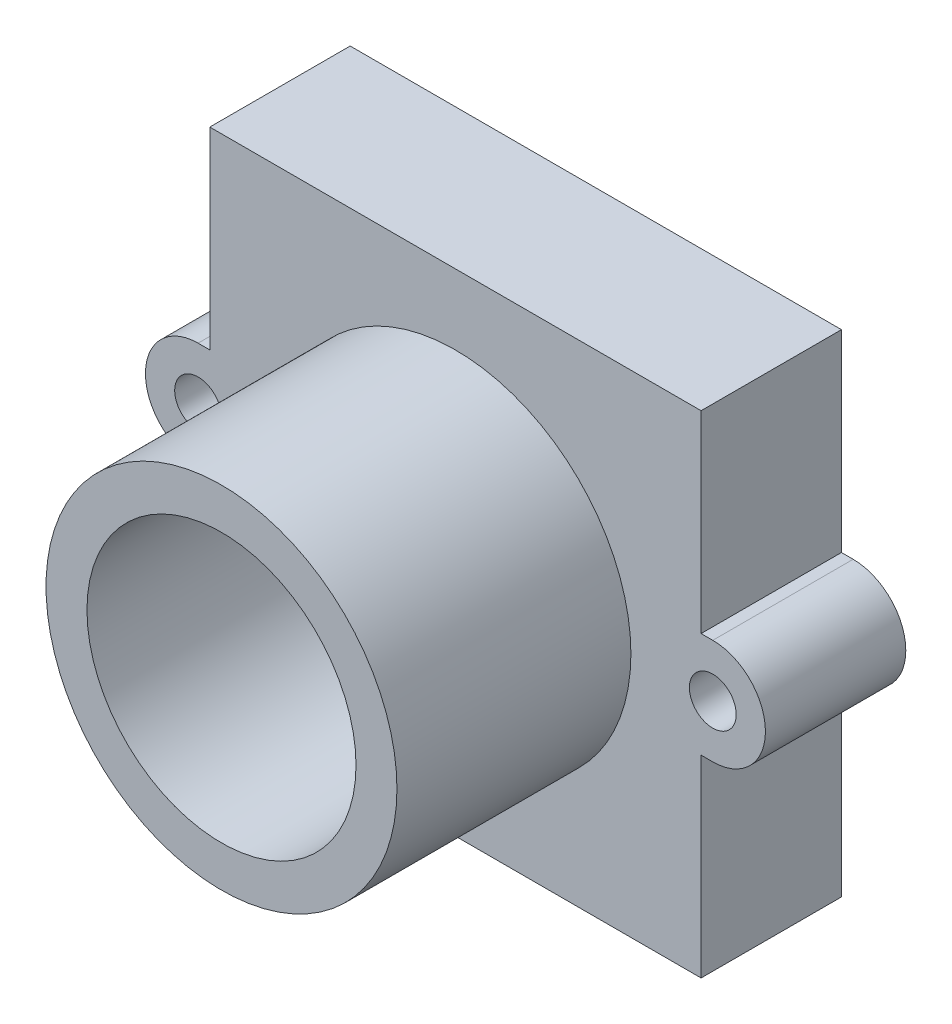
ISO-10303-21;
HEADER;
FILE_DESCRIPTION(('STEP AP214'),'2;1');
FILE_NAME('part.step','',(''),(''),'','','');
FILE_SCHEMA(('AUTOMOTIVE_DESIGN { 1 0 10303 214 1 1 1 1 }'));
ENDSEC;
DATA;
#1=APPLICATION_CONTEXT('core data for automotive mechanical design processes');
#2=APPLICATION_PROTOCOL_DEFINITION('international standard','automotive_design',2000,#1);
#3=PRODUCT_CONTEXT('',#1,'mechanical');
#4=PRODUCT('Part','Part','',(#3));
#5=PRODUCT_RELATED_PRODUCT_CATEGORY('part','',(#4));
#6=PRODUCT_DEFINITION_FORMATION('','',#4);
#7=PRODUCT_DEFINITION_CONTEXT('part definition',#1,'design');
#8=PRODUCT_DEFINITION('design','',#6,#7);
#9=PRODUCT_DEFINITION_SHAPE('','',#8);
#10=(LENGTH_UNIT() NAMED_UNIT(*) SI_UNIT(.MILLI.,.METRE.));
#11=(NAMED_UNIT(*) PLANE_ANGLE_UNIT() SI_UNIT($,.RADIAN.));
#12=(NAMED_UNIT(*) SI_UNIT($,.STERADIAN.) SOLID_ANGLE_UNIT());
#13=UNCERTAINTY_MEASURE_WITH_UNIT(LENGTH_MEASURE(1.E-05),#10,'distance_accuracy_value','');
#14=(GEOMETRIC_REPRESENTATION_CONTEXT(3) GLOBAL_UNCERTAINTY_ASSIGNED_CONTEXT((#13)) GLOBAL_UNIT_ASSIGNED_CONTEXT((#10,
#11,#12)) REPRESENTATION_CONTEXT('',''));
#15=CARTESIAN_POINT('',(0.,0.,0.));
#16=DIRECTION('',(0.,0.,1.));
#17=DIRECTION('',(1.,0.,0.));
#18=AXIS2_PLACEMENT_3D('',#15,#16,#17);
#19=CARTESIAN_POINT('',(0.,0.,6.));
#20=DIRECTION('',(0.,0.,1.));
#21=DIRECTION('',(1.,0.,0.));
#22=AXIS2_PLACEMENT_3D('',#19,#20,#21);
#23=PLANE('',#22);
#24=CARTESIAN_POINT('',(-11.,0.,6.));
#25=DIRECTION('',(0.,0.,1.));
#26=DIRECTION('',(1.,0.,0.));
#27=AXIS2_PLACEMENT_3D('',#24,#25,#26);
#28=CIRCLE('',#27,0.999999999999987);
#29=CARTESIAN_POINT('',(-10.,0.,6.));
#30=VERTEX_POINT('',#29);
#31=EDGE_CURVE('E585',#30,#30,#28,.T.);
#32=ORIENTED_EDGE('',*,*,#31,.F.);
#33=EDGE_LOOP('',(#32));
#34=FACE_BOUND('',#33,.T.);
#35=CARTESIAN_POINT('',(11.,0.,6.));
#36=DIRECTION('',(0.,0.,1.));
#37=DIRECTION('',(1.,0.,0.));
#38=AXIS2_PLACEMENT_3D('',#35,#36,#37);
#39=CIRCLE('',#38,0.999999999999987);
#40=CARTESIAN_POINT('',(12.,0.,6.));
#41=VERTEX_POINT('',#40);
#42=EDGE_CURVE('E587',#41,#41,#39,.T.);
#43=ORIENTED_EDGE('',*,*,#42,.F.);
#44=EDGE_LOOP('',(#43));
#45=FACE_BOUND('',#44,.T.);
#46=CARTESIAN_POINT('',(11.,0.,6.));
#47=DIRECTION('',(0.,0.,1.));
#48=DIRECTION('',(1.,0.,0.));
#49=AXIS2_PLACEMENT_3D('',#46,#47,#48);
#50=CIRCLE('',#49,2.25);
#51=CARTESIAN_POINT('',(11.,2.25,6.));
#52=VERTEX_POINT('',#51);
#53=CARTESIAN_POINT('',(11.,-2.25,6.));
#54=VERTEX_POINT('',#53);
#55=EDGE_CURVE('E179',#52,#54,#50,.F.);
#56=ORIENTED_EDGE('',*,*,#55,.F.);
#57=DIRECTION('',(1.,0.,0.));
#58=VECTOR('',#57,1.);
#59=CARTESIAN_POINT('',(0.,2.25000000000001,6.));
#60=LINE('',#59,#58);
#61=CARTESIAN_POINT('',(10.5,2.25,6.));
#62=VERTEX_POINT('',#61);
#63=EDGE_CURVE('E194',#62,#52,#60,.T.);
#64=ORIENTED_EDGE('',*,*,#63,.F.);
#65=DIRECTION('',(0.,-1.,0.));
#66=VECTOR('',#65,1.);
#67=CARTESIAN_POINT('',(10.5,0.,6.));
#68=LINE('',#67,#66);
#69=CARTESIAN_POINT('',(10.5,10.5,6.));
#70=VERTEX_POINT('',#69);
#71=EDGE_CURVE('E202',#70,#62,#68,.T.);
#72=ORIENTED_EDGE('',*,*,#71,.F.);
#73=DIRECTION('',(1.,0.,0.));
#74=VECTOR('',#73,1.);
#75=CARTESIAN_POINT('',(0.,10.5,6.));
#76=LINE('',#75,#74);
#77=CARTESIAN_POINT('',(-10.5,10.5,6.));
#78=VERTEX_POINT('',#77);
#79=EDGE_CURVE('E204',#78,#70,#76,.T.);
#80=ORIENTED_EDGE('',*,*,#79,.F.);
#81=DIRECTION('',(0.,-1.,0.));
#82=VECTOR('',#81,1.);
#83=CARTESIAN_POINT('',(-10.5,0.,6.));
#84=LINE('',#83,#82);
#85=CARTESIAN_POINT('',(-10.5,2.25,6.));
#86=VERTEX_POINT('',#85);
#87=EDGE_CURVE('E210',#78,#86,#84,.T.);
#88=ORIENTED_EDGE('',*,*,#87,.T.);
#89=DIRECTION('',(-1.,0.,0.));
#90=VECTOR('',#89,1.);
#91=CARTESIAN_POINT('',(0.,2.25000000000001,6.));
#92=LINE('',#91,#90);
#93=CARTESIAN_POINT('',(-11.,2.25,6.));
#94=VERTEX_POINT('',#93);
#95=EDGE_CURVE('E213',#86,#94,#92,.T.);
#96=ORIENTED_EDGE('',*,*,#95,.T.);
#97=CARTESIAN_POINT('',(-11.,0.,6.));
#98=DIRECTION('',(0.,0.,1.));
#99=DIRECTION('',(1.,0.,0.));
#100=AXIS2_PLACEMENT_3D('',#97,#98,#99);
#101=CIRCLE('',#100,2.25);
#102=CARTESIAN_POINT('',(-11.,-2.25,6.));
#103=VERTEX_POINT('',#102);
#104=EDGE_CURVE('E216',#94,#103,#101,.T.);
#105=ORIENTED_EDGE('',*,*,#104,.T.);
#106=DIRECTION('',(1.,0.,0.));
#107=VECTOR('',#106,1.);
#108=CARTESIAN_POINT('',(0.,-2.25,6.));
#109=LINE('',#108,#107);
#110=CARTESIAN_POINT('',(-10.5,-2.25,6.));
#111=VERTEX_POINT('',#110);
#112=EDGE_CURVE('E219',#103,#111,#109,.T.);
#113=ORIENTED_EDGE('',*,*,#112,.T.);
#114=DIRECTION('',(0.,-1.,0.));
#115=VECTOR('',#114,1.);
#116=CARTESIAN_POINT('',(-10.5,0.,6.));
#117=LINE('',#116,#115);
#118=CARTESIAN_POINT('',(-10.5,-10.5,6.));
#119=VERTEX_POINT('',#118);
#120=EDGE_CURVE('E222',#111,#119,#117,.T.);
#121=ORIENTED_EDGE('',*,*,#120,.T.);
#122=DIRECTION('',(1.,0.,0.));
#123=VECTOR('',#122,1.);
#124=CARTESIAN_POINT('',(0.,-10.5,6.));
#125=LINE('',#124,#123);
#126=CARTESIAN_POINT('',(10.5,-10.5,6.));
#127=VERTEX_POINT('',#126);
#128=EDGE_CURVE('E225',#119,#127,#125,.T.);
#129=ORIENTED_EDGE('',*,*,#128,.T.);
#130=DIRECTION('',(0.,-1.,0.));
#131=VECTOR('',#130,1.);
#132=CARTESIAN_POINT('',(10.5,0.,6.));
#133=LINE('',#132,#131);
#134=CARTESIAN_POINT('',(10.5,-2.25,6.));
#135=VERTEX_POINT('',#134);
#136=EDGE_CURVE('E228',#135,#127,#133,.T.);
#137=ORIENTED_EDGE('',*,*,#136,.F.);
#138=DIRECTION('',(-1.,0.,0.));
#139=VECTOR('',#138,1.);
#140=CARTESIAN_POINT('',(0.,-2.25,6.));
#141=LINE('',#140,#139);
#142=EDGE_CURVE('E198',#54,#135,#141,.T.);
#143=ORIENTED_EDGE('',*,*,#142,.F.);
#144=EDGE_LOOP('',(#56,#64,#72,#80,#88,#96,#105,#113,#121,#129,#137,#143));
#145=FACE_BOUND('',#144,.T.);
#146=CARTESIAN_POINT('',(0.,0.,6.));
#147=DIRECTION('',(0.,0.,1.));
#148=DIRECTION('',(1.,0.,0.));
#149=AXIS2_PLACEMENT_3D('',#146,#147,#148);
#150=CIRCLE('',#149,7.5);
#151=CARTESIAN_POINT('',(7.5,0.,6.));
#152=VERTEX_POINT('',#151);
#153=EDGE_CURVE('E601',#152,#152,#150,.T.);
#154=ORIENTED_EDGE('',*,*,#153,.F.);
#155=EDGE_LOOP('',(#154));
#156=FACE_BOUND('',#155,.T.);
#157=ADVANCED_FACE('F37',(#34,#45,#145,#156),#23,.T.);
#158=CARTESIAN_POINT('',(-10.5,10.5,0.));
#159=DIRECTION('',(-1.,0.,0.));
#160=DIRECTION('',(0.,0.,1.));
#161=AXIS2_PLACEMENT_3D('',#158,#159,#160);
#162=PLANE('',#161);
#163=DIRECTION('',(0.,0.,1.));
#164=VECTOR('',#163,1.);
#165=CARTESIAN_POINT('',(-10.5,2.25,0.));
#166=LINE('',#165,#164);
#167=CARTESIAN_POINT('',(-10.5,2.25,0.));
#168=VERTEX_POINT('',#167);
#169=EDGE_CURVE('E41',#168,#86,#166,.T.);
#170=ORIENTED_EDGE('',*,*,#169,.T.);
#171=ORIENTED_EDGE('',*,*,#87,.F.);
#172=DIRECTION('',(0.,0.,1.));
#173=VECTOR('',#172,1.);
#174=CARTESIAN_POINT('',(-10.5,10.5,0.));
#175=LINE('',#174,#173);
#176=CARTESIAN_POINT('',(-10.5,10.5,0.));
#177=VERTEX_POINT('',#176);
#178=EDGE_CURVE('E11',#177,#78,#175,.T.);
#179=ORIENTED_EDGE('',*,*,#178,.F.);
#180=DIRECTION('',(0.,-1.,0.));
#181=VECTOR('',#180,1.);
#182=CARTESIAN_POINT('',(-10.5,10.5,0.));
#183=LINE('',#182,#181);
#184=EDGE_CURVE('E282',#177,#168,#183,.T.);
#185=ORIENTED_EDGE('',*,*,#184,.T.);
#186=EDGE_LOOP('',(#170,#171,#179,#185));
#187=FACE_BOUND('',#186,.T.);
#188=ADVANCED_FACE('F39',(#187),#162,.T.);
#189=CARTESIAN_POINT('',(-10.5,10.5,0.));
#190=DIRECTION('',(0.,1.,0.));
#191=DIRECTION('',(0.,0.,1.));
#192=AXIS2_PLACEMENT_3D('',#189,#190,#191);
#193=PLANE('',#192);
#194=ORIENTED_EDGE('',*,*,#178,.T.);
#195=ORIENTED_EDGE('',*,*,#79,.T.);
#196=DIRECTION('',(0.,0.,1.));
#197=VECTOR('',#196,1.);
#198=CARTESIAN_POINT('',(10.5,10.5,0.));
#199=LINE('',#198,#197);
#200=CARTESIAN_POINT('',(10.5,10.5,0.));
#201=VERTEX_POINT('',#200);
#202=EDGE_CURVE('E46',#201,#70,#199,.T.);
#203=ORIENTED_EDGE('',*,*,#202,.F.);
#204=DIRECTION('',(-1.,0.,0.));
#205=VECTOR('',#204,1.);
#206=CARTESIAN_POINT('',(-10.5,10.5,0.));
#207=LINE('',#206,#205);
#208=EDGE_CURVE('E330',#201,#177,#207,.T.);
#209=ORIENTED_EDGE('',*,*,#208,.T.);
#210=EDGE_LOOP('',(#194,#195,#203,#209));
#211=FACE_BOUND('',#210,.T.);
#212=ADVANCED_FACE('F371',(#211),#193,.T.);
#213=CARTESIAN_POINT('',(10.5,10.5,0.));
#214=DIRECTION('',(1.,0.,0.));
#215=DIRECTION('',(0.,0.,-1.));
#216=AXIS2_PLACEMENT_3D('',#213,#214,#215);
#217=PLANE('',#216);
#218=ORIENTED_EDGE('',*,*,#202,.T.);
#219=ORIENTED_EDGE('',*,*,#71,.T.);
#220=DIRECTION('',(0.,0.,1.));
#221=VECTOR('',#220,1.);
#222=CARTESIAN_POINT('',(10.5,2.25,0.));
#223=LINE('',#222,#221);
#224=CARTESIAN_POINT('',(10.5,2.25,0.));
#225=VERTEX_POINT('',#224);
#226=EDGE_CURVE('E187',#225,#62,#223,.T.);
#227=ORIENTED_EDGE('',*,*,#226,.F.);
#228=DIRECTION('',(0.,1.,0.));
#229=VECTOR('',#228,1.);
#230=CARTESIAN_POINT('',(10.5,10.5,0.));
#231=LINE('',#230,#229);
#232=EDGE_CURVE('E327',#225,#201,#231,.T.);
#233=ORIENTED_EDGE('',*,*,#232,.T.);
#234=EDGE_LOOP('',(#218,#219,#227,#233));
#235=FACE_BOUND('',#234,.T.);
#236=ADVANCED_FACE('F414',(#235),#217,.T.);
#237=CARTESIAN_POINT('',(10.5,2.25,0.));
#238=DIRECTION('',(0.,1.,0.));
#239=DIRECTION('',(-1.,0.,0.));
#240=AXIS2_PLACEMENT_3D('',#237,#238,#239);
#241=PLANE('',#240);
#242=ORIENTED_EDGE('',*,*,#226,.T.);
#243=ORIENTED_EDGE('',*,*,#63,.T.);
#244=DIRECTION('',(0.,0.,1.));
#245=VECTOR('',#244,1.);
#246=CARTESIAN_POINT('',(11.,2.25,0.));
#247=LINE('',#246,#245);
#248=CARTESIAN_POINT('',(11.,2.25,0.));
#249=VERTEX_POINT('',#248);
#250=EDGE_CURVE('E176',#249,#52,#247,.T.);
#251=ORIENTED_EDGE('',*,*,#250,.F.);
#252=DIRECTION('',(-1.,0.,0.));
#253=VECTOR('',#252,1.);
#254=CARTESIAN_POINT('',(10.5,2.25,0.));
#255=LINE('',#254,#253);
#256=EDGE_CURVE('E325',#249,#225,#255,.T.);
#257=ORIENTED_EDGE('',*,*,#256,.T.);
#258=EDGE_LOOP('',(#242,#243,#251,#257));
#259=FACE_BOUND('',#258,.T.);
#260=ADVANCED_FACE('F201',(#259),#241,.T.);
#261=CARTESIAN_POINT('',(11.,0.,0.));
#262=DIRECTION('',(0.,0.,1.));
#263=DIRECTION('',(1.,0.,0.));
#264=AXIS2_PLACEMENT_3D('',#261,#262,#263);
#265=CYLINDRICAL_SURFACE('',#264,2.25);
#266=ORIENTED_EDGE('',*,*,#250,.T.);
#267=ORIENTED_EDGE('',*,*,#55,.T.);
#268=DIRECTION('',(0.,0.,1.));
#269=VECTOR('',#268,1.);
#270=CARTESIAN_POINT('',(11.,-2.25,0.));
#271=LINE('',#270,#269);
#272=CARTESIAN_POINT('',(11.,-2.25,0.));
#273=VERTEX_POINT('',#272);
#274=EDGE_CURVE('E188',#273,#54,#271,.T.);
#275=ORIENTED_EDGE('',*,*,#274,.F.);
#276=CARTESIAN_POINT('',(11.,0.,0.));
#277=DIRECTION('',(0.,0.,1.));
#278=DIRECTION('',(-1.,0.,0.));
#279=AXIS2_PLACEMENT_3D('',#276,#277,#278);
#280=CIRCLE('',#279,2.25);
#281=EDGE_CURVE('E182',#273,#249,#280,.T.);
#282=ORIENTED_EDGE('',*,*,#281,.T.);
#283=EDGE_LOOP('',(#266,#267,#275,#282));
#284=FACE_BOUND('',#283,.T.);
#285=ADVANCED_FACE('F178',(#284),#265,.T.);
#286=CARTESIAN_POINT('',(11.,-2.25,0.));
#287=DIRECTION('',(0.,-1.,0.));
#288=DIRECTION('',(0.,0.,-1.));
#289=AXIS2_PLACEMENT_3D('',#286,#287,#288);
#290=PLANE('',#289);
#291=ORIENTED_EDGE('',*,*,#274,.T.);
#292=ORIENTED_EDGE('',*,*,#142,.T.);
#293=DIRECTION('',(0.,0.,1.));
#294=VECTOR('',#293,1.);
#295=CARTESIAN_POINT('',(10.5,-2.25,0.));
#296=LINE('',#295,#294);
#297=CARTESIAN_POINT('',(10.5,-2.25,0.));
#298=VERTEX_POINT('',#297);
#299=EDGE_CURVE('E336',#298,#135,#296,.T.);
#300=ORIENTED_EDGE('',*,*,#299,.F.);
#301=DIRECTION('',(1.,0.,0.));
#302=VECTOR('',#301,1.);
#303=CARTESIAN_POINT('',(11.,-2.25,0.));
#304=LINE('',#303,#302);
#305=EDGE_CURVE('E321',#298,#273,#304,.T.);
#306=ORIENTED_EDGE('',*,*,#305,.T.);
#307=EDGE_LOOP('',(#291,#292,#300,#306));
#308=FACE_BOUND('',#307,.T.);
#309=ADVANCED_FACE('F423',(#308),#290,.T.);
#310=CARTESIAN_POINT('',(10.5,-2.25,0.));
#311=DIRECTION('',(1.,0.,0.));
#312=DIRECTION('',(0.,0.,-1.));
#313=AXIS2_PLACEMENT_3D('',#310,#311,#312);
#314=PLANE('',#313);
#315=ORIENTED_EDGE('',*,*,#299,.T.);
#316=ORIENTED_EDGE('',*,*,#136,.T.);
#317=DIRECTION('',(0.,0.,1.));
#318=VECTOR('',#317,1.);
#319=CARTESIAN_POINT('',(10.5,-10.5,0.));
#320=LINE('',#319,#318);
#321=CARTESIAN_POINT('',(10.5,-10.5,0.));
#322=VERTEX_POINT('',#321);
#323=EDGE_CURVE('E338',#322,#127,#320,.T.);
#324=ORIENTED_EDGE('',*,*,#323,.F.);
#325=DIRECTION('',(0.,1.,0.));
#326=VECTOR('',#325,1.);
#327=CARTESIAN_POINT('',(10.5,-2.25,0.));
#328=LINE('',#327,#326);
#329=EDGE_CURVE('E318',#322,#298,#328,.T.);
#330=ORIENTED_EDGE('',*,*,#329,.T.);
#331=EDGE_LOOP('',(#315,#316,#324,#330));
#332=FACE_BOUND('',#331,.T.);
#333=ADVANCED_FACE('F426',(#332),#314,.T.);
#334=CARTESIAN_POINT('',(-10.5,-10.5,0.));
#335=DIRECTION('',(0.,-1.,0.));
#336=DIRECTION('',(0.,0.,-1.));
#337=AXIS2_PLACEMENT_3D('',#334,#335,#336);
#338=PLANE('',#337);
#339=ORIENTED_EDGE('',*,*,#323,.T.);
#340=ORIENTED_EDGE('',*,*,#128,.F.);
#341=DIRECTION('',(0.,0.,1.));
#342=VECTOR('',#341,1.);
#343=CARTESIAN_POINT('',(-10.5,-10.5,0.));
#344=LINE('',#343,#342);
#345=CARTESIAN_POINT('',(-10.5,-10.5,0.));
#346=VERTEX_POINT('',#345);
#347=EDGE_CURVE('E340',#346,#119,#344,.T.);
#348=ORIENTED_EDGE('',*,*,#347,.F.);
#349=DIRECTION('',(1.,0.,0.));
#350=VECTOR('',#349,1.);
#351=CARTESIAN_POINT('',(-10.5,-10.5,0.));
#352=LINE('',#351,#350);
#353=EDGE_CURVE('E315',#346,#322,#352,.T.);
#354=ORIENTED_EDGE('',*,*,#353,.T.);
#355=EDGE_LOOP('',(#339,#340,#348,#354));
#356=FACE_BOUND('',#355,.T.);
#357=ADVANCED_FACE('F430',(#356),#338,.T.);
#358=CARTESIAN_POINT('',(-10.5,-2.25,0.));
#359=DIRECTION('',(-1.,0.,0.));
#360=DIRECTION('',(0.,0.,1.));
#361=AXIS2_PLACEMENT_3D('',#358,#359,#360);
#362=PLANE('',#361);
#363=ORIENTED_EDGE('',*,*,#347,.T.);
#364=ORIENTED_EDGE('',*,*,#120,.F.);
#365=DIRECTION('',(0.,0.,1.));
#366=VECTOR('',#365,1.);
#367=CARTESIAN_POINT('',(-10.5,-2.25,0.));
#368=LINE('',#367,#366);
#369=CARTESIAN_POINT('',(-10.5,-2.25,0.));
#370=VERTEX_POINT('',#369);
#371=EDGE_CURVE('E342',#370,#111,#368,.T.);
#372=ORIENTED_EDGE('',*,*,#371,.F.);
#373=DIRECTION('',(0.,-1.,0.));
#374=VECTOR('',#373,1.);
#375=CARTESIAN_POINT('',(-10.5,-2.25,0.));
#376=LINE('',#375,#374);
#377=EDGE_CURVE('E312',#370,#346,#376,.T.);
#378=ORIENTED_EDGE('',*,*,#377,.T.);
#379=EDGE_LOOP('',(#363,#364,#372,#378));
#380=FACE_BOUND('',#379,.T.);
#381=ADVANCED_FACE('F434',(#380),#362,.T.);
#382=CARTESIAN_POINT('',(-11.,-2.25,0.));
#383=DIRECTION('',(0.,-1.,0.));
#384=DIRECTION('',(0.,0.,-1.));
#385=AXIS2_PLACEMENT_3D('',#382,#383,#384);
#386=PLANE('',#385);
#387=ORIENTED_EDGE('',*,*,#371,.T.);
#388=ORIENTED_EDGE('',*,*,#112,.F.);
#389=DIRECTION('',(0.,0.,1.));
#390=VECTOR('',#389,1.);
#391=CARTESIAN_POINT('',(-11.,-2.25,0.));
#392=LINE('',#391,#390);
#393=CARTESIAN_POINT('',(-11.,-2.25,0.));
#394=VERTEX_POINT('',#393);
#395=EDGE_CURVE('E344',#394,#103,#392,.T.);
#396=ORIENTED_EDGE('',*,*,#395,.F.);
#397=DIRECTION('',(1.,0.,0.));
#398=VECTOR('',#397,1.);
#399=CARTESIAN_POINT('',(-11.,-2.25,0.));
#400=LINE('',#399,#398);
#401=EDGE_CURVE('E309',#394,#370,#400,.T.);
#402=ORIENTED_EDGE('',*,*,#401,.T.);
#403=EDGE_LOOP('',(#387,#388,#396,#402));
#404=FACE_BOUND('',#403,.T.);
#405=ADVANCED_FACE('F362',(#404),#386,.T.);
#406=CARTESIAN_POINT('',(-11.,0.,0.));
#407=DIRECTION('',(0.,0.,1.));
#408=DIRECTION('',(1.,0.,0.));
#409=AXIS2_PLACEMENT_3D('',#406,#407,#408);
#410=CYLINDRICAL_SURFACE('',#409,2.25);
#411=ORIENTED_EDGE('',*,*,#395,.T.);
#412=ORIENTED_EDGE('',*,*,#104,.F.);
#413=DIRECTION('',(0.,0.,1.));
#414=VECTOR('',#413,1.);
#415=CARTESIAN_POINT('',(-11.,2.25,0.));
#416=LINE('',#415,#414);
#417=CARTESIAN_POINT('',(-11.,2.25,0.));
#418=VERTEX_POINT('',#417);
#419=EDGE_CURVE('E345',#418,#94,#416,.T.);
#420=ORIENTED_EDGE('',*,*,#419,.F.);
#421=CARTESIAN_POINT('',(-11.,0.,0.));
#422=DIRECTION('',(0.,0.,1.));
#423=DIRECTION('',(1.,0.,0.));
#424=AXIS2_PLACEMENT_3D('',#421,#422,#423);
#425=CIRCLE('',#424,2.25);
#426=EDGE_CURVE('E306',#418,#394,#425,.T.);
#427=ORIENTED_EDGE('',*,*,#426,.T.);
#428=EDGE_LOOP('',(#411,#412,#420,#427));
#429=FACE_BOUND('',#428,.T.);
#430=ADVANCED_FACE('F354',(#429),#410,.T.);
#431=CARTESIAN_POINT('',(-10.5,2.25,0.));
#432=DIRECTION('',(0.,1.,0.));
#433=DIRECTION('',(-1.,0.,0.));
#434=AXIS2_PLACEMENT_3D('',#431,#432,#433);
#435=PLANE('',#434);
#436=ORIENTED_EDGE('',*,*,#419,.T.);
#437=ORIENTED_EDGE('',*,*,#95,.F.);
#438=ORIENTED_EDGE('',*,*,#169,.F.);
#439=DIRECTION('',(-1.,0.,0.));
#440=VECTOR('',#439,1.);
#441=CARTESIAN_POINT('',(-10.5,2.25,0.));
#442=LINE('',#441,#440);
#443=EDGE_CURVE('E303',#168,#418,#442,.T.);
#444=ORIENTED_EDGE('',*,*,#443,.T.);
#445=EDGE_LOOP('',(#436,#437,#438,#444));
#446=FACE_BOUND('',#445,.T.);
#447=ADVANCED_FACE('F351',(#446),#435,.T.);
#448=CARTESIAN_POINT('',(-11.,0.,0.));
#449=DIRECTION('',(0.,0.,1.));
#450=DIRECTION('',(1.,0.,0.));
#451=AXIS2_PLACEMENT_3D('',#448,#449,#450);
#452=PLANE('',#451);
#453=CARTESIAN_POINT('',(-11.,0.,0.));
#454=DIRECTION('',(0.,0.,1.));
#455=DIRECTION('',(1.,0.,0.));
#456=AXIS2_PLACEMENT_3D('',#453,#454,#455);
#457=CIRCLE('',#456,0.999999999999997);
#458=CARTESIAN_POINT('',(-10.,0.,0.));
#459=VERTEX_POINT('',#458);
#460=EDGE_CURVE('E583',#459,#459,#457,.T.);
#461=ORIENTED_EDGE('',*,*,#460,.T.);
#462=EDGE_LOOP('',(#461));
#463=FACE_BOUND('',#462,.T.);
#464=CARTESIAN_POINT('',(11.,0.,0.));
#465=DIRECTION('',(0.,0.,1.));
#466=DIRECTION('',(1.,0.,0.));
#467=AXIS2_PLACEMENT_3D('',#464,#465,#466);
#468=CIRCLE('',#467,0.999999999999997);
#469=CARTESIAN_POINT('',(12.,0.,0.));
#470=VERTEX_POINT('',#469);
#471=EDGE_CURVE('E592',#470,#470,#468,.T.);
#472=ORIENTED_EDGE('',*,*,#471,.T.);
#473=EDGE_LOOP('',(#472));
#474=FACE_BOUND('',#473,.T.);
#475=DIRECTION('',(0.707106781186547,-0.707106781186548,0.));
#476=VECTOR('',#475,1.);
#477=CARTESIAN_POINT('',(-9.,-6.48563850798539,0.));
#478=LINE('',#477,#476);
#479=CARTESIAN_POINT('',(-9.,-6.48563850798539,0.));
#480=VERTEX_POINT('',#479);
#481=CARTESIAN_POINT('',(-6.48563850798539,-9.,0.));
#482=VERTEX_POINT('',#481);
#483=EDGE_CURVE('E253',#480,#482,#478,.T.);
#484=ORIENTED_EDGE('',*,*,#483,.T.);
#485=DIRECTION('',(1.,0.,0.));
#486=VECTOR('',#485,1.);
#487=CARTESIAN_POINT('',(-6.48563850798539,-9.,0.));
#488=LINE('',#487,#486);
#489=CARTESIAN_POINT('',(6.48563850798539,-9.,0.));
#490=VERTEX_POINT('',#489);
#491=EDGE_CURVE('E233',#482,#490,#488,.T.);
#492=ORIENTED_EDGE('',*,*,#491,.T.);
#493=DIRECTION('',(0.707106781186548,0.707106781186548,0.));
#494=VECTOR('',#493,1.);
#495=CARTESIAN_POINT('',(6.48563850798539,-9.,0.));
#496=LINE('',#495,#494);
#497=CARTESIAN_POINT('',(9.,-6.48563850798539,0.));
#498=VERTEX_POINT('',#497);
#499=EDGE_CURVE('E236',#490,#498,#496,.T.);
#500=ORIENTED_EDGE('',*,*,#499,.T.);
#501=DIRECTION('',(0.,1.,0.));
#502=VECTOR('',#501,1.);
#503=CARTESIAN_POINT('',(9.,-6.48563850798539,0.));
#504=LINE('',#503,#502);
#505=CARTESIAN_POINT('',(9.,6.48563850798539,0.));
#506=VERTEX_POINT('',#505);
#507=EDGE_CURVE('E54',#498,#506,#504,.T.);
#508=ORIENTED_EDGE('',*,*,#507,.T.);
#509=DIRECTION('',(-0.707106781186547,0.707106781186548,0.));
#510=VECTOR('',#509,1.);
#511=CARTESIAN_POINT('',(9.,6.48563850798539,0.));
#512=LINE('',#511,#510);
#513=CARTESIAN_POINT('',(6.48563850798539,9.,0.));
#514=VERTEX_POINT('',#513);
#515=EDGE_CURVE('E241',#506,#514,#512,.T.);
#516=ORIENTED_EDGE('',*,*,#515,.T.);
#517=DIRECTION('',(-1.,0.,0.));
#518=VECTOR('',#517,1.);
#519=CARTESIAN_POINT('',(6.48563850798539,9.,0.));
#520=LINE('',#519,#518);
#521=CARTESIAN_POINT('',(-6.48563850798539,9.,0.));
#522=VERTEX_POINT('',#521);
#523=EDGE_CURVE('E244',#514,#522,#520,.T.);
#524=ORIENTED_EDGE('',*,*,#523,.T.);
#525=DIRECTION('',(-0.707106781186547,-0.707106781186548,0.));
#526=VECTOR('',#525,1.);
#527=CARTESIAN_POINT('',(-6.48563850798539,9.,0.));
#528=LINE('',#527,#526);
#529=CARTESIAN_POINT('',(-9.,6.48563850798539,0.));
#530=VERTEX_POINT('',#529);
#531=EDGE_CURVE('E247',#522,#530,#528,.T.);
#532=ORIENTED_EDGE('',*,*,#531,.T.);
#533=DIRECTION('',(0.,-1.,0.));
#534=VECTOR('',#533,1.);
#535=CARTESIAN_POINT('',(-9.,6.48563850798539,0.));
#536=LINE('',#535,#534);
#537=EDGE_CURVE('E250',#530,#480,#536,.T.);
#538=ORIENTED_EDGE('',*,*,#537,.T.);
#539=EDGE_LOOP('',(#484,#492,#500,#508,#516,#524,#532,#538));
#540=FACE_BOUND('',#539,.T.);
#541=ORIENTED_EDGE('',*,*,#184,.F.);
#542=ORIENTED_EDGE('',*,*,#208,.F.);
#543=ORIENTED_EDGE('',*,*,#232,.F.);
#544=ORIENTED_EDGE('',*,*,#256,.F.);
#545=ORIENTED_EDGE('',*,*,#281,.F.);
#546=ORIENTED_EDGE('',*,*,#305,.F.);
#547=ORIENTED_EDGE('',*,*,#329,.F.);
#548=ORIENTED_EDGE('',*,*,#353,.F.);
#549=ORIENTED_EDGE('',*,*,#377,.F.);
#550=ORIENTED_EDGE('',*,*,#401,.F.);
#551=ORIENTED_EDGE('',*,*,#426,.F.);
#552=ORIENTED_EDGE('',*,*,#443,.F.);
#553=EDGE_LOOP('',(#541,#542,#543,#544,#545,#546,#547,#548,#549,#550,#551,#552));
#554=FACE_BOUND('',#553,.T.);
#555=ADVANCED_FACE('F353',(#463,#474,#540,#554),#452,.F.);
#556=CARTESIAN_POINT('',(-6.48563850798539,-9.,0.));
#557=DIRECTION('',(0.,-1.,0.));
#558=DIRECTION('',(0.,0.,-1.));
#559=AXIS2_PLACEMENT_3D('',#556,#557,#558);
#560=PLANE('',#559);
#561=DIRECTION('',(1.,0.,0.));
#562=VECTOR('',#561,1.);
#563=CARTESIAN_POINT('',(-6.48563850798539,-9.,5.));
#564=LINE('',#563,#562);
#565=CARTESIAN_POINT('',(-6.48563850798539,-9.,5.));
#566=VERTEX_POINT('',#565);
#567=CARTESIAN_POINT('',(6.48563850798539,-9.,5.));
#568=VERTEX_POINT('',#567);
#569=EDGE_CURVE('E232',#566,#568,#564,.T.);
#570=ORIENTED_EDGE('',*,*,#569,.T.);
#571=DIRECTION('',(0.,0.,1.));
#572=VECTOR('',#571,1.);
#573=CARTESIAN_POINT('',(6.48563850798539,-9.,0.));
#574=LINE('',#573,#572);
#575=EDGE_CURVE('E256',#490,#568,#574,.T.);
#576=ORIENTED_EDGE('',*,*,#575,.F.);
#577=ORIENTED_EDGE('',*,*,#491,.F.);
#578=DIRECTION('',(0.,0.,1.));
#579=VECTOR('',#578,1.);
#580=CARTESIAN_POINT('',(-6.48563850798539,-9.,0.));
#581=LINE('',#580,#579);
#582=EDGE_CURVE('E279',#482,#566,#581,.T.);
#583=ORIENTED_EDGE('',*,*,#582,.T.);
#584=EDGE_LOOP('',(#570,#576,#577,#583));
#585=FACE_BOUND('',#584,.T.);
#586=ADVANCED_FACE('F359',(#585),#560,.F.);
#587=CARTESIAN_POINT('',(-9.,-6.48563850798539,0.));
#588=DIRECTION('',(-0.707106781186548,-0.707106781186547,0.));
#589=DIRECTION('',(0.707106781186547,-0.707106781186548,0.));
#590=AXIS2_PLACEMENT_3D('',#587,#588,#589);
#591=PLANE('',#590);
#592=DIRECTION('',(0.707106781186547,-0.707106781186548,0.));
#593=VECTOR('',#592,1.);
#594=CARTESIAN_POINT('',(-9.,-6.48563850798539,5.));
#595=LINE('',#594,#593);
#596=CARTESIAN_POINT('',(-9.,-6.48563850798539,5.));
#597=VERTEX_POINT('',#596);
#598=EDGE_CURVE('E237',#597,#566,#595,.T.);
#599=ORIENTED_EDGE('',*,*,#598,.T.);
#600=ORIENTED_EDGE('',*,*,#582,.F.);
#601=ORIENTED_EDGE('',*,*,#483,.F.);
#602=DIRECTION('',(0.,0.,1.));
#603=VECTOR('',#602,1.);
#604=CARTESIAN_POINT('',(-9.,-6.48563850798539,0.));
#605=LINE('',#604,#603);
#606=EDGE_CURVE('E283',#480,#597,#605,.T.);
#607=ORIENTED_EDGE('',*,*,#606,.T.);
#608=EDGE_LOOP('',(#599,#600,#601,#607));
#609=FACE_BOUND('',#608,.T.);
#610=ADVANCED_FACE('F383',(#609),#591,.F.);
#611=CARTESIAN_POINT('',(-9.,6.48563850798539,0.));
#612=DIRECTION('',(-1.,0.,0.));
#613=DIRECTION('',(0.,0.,1.));
#614=AXIS2_PLACEMENT_3D('',#611,#612,#613);
#615=PLANE('',#614);
#616=DIRECTION('',(0.,-1.,0.));
#617=VECTOR('',#616,1.);
#618=CARTESIAN_POINT('',(-9.,6.48563850798539,5.));
#619=LINE('',#618,#617);
#620=CARTESIAN_POINT('',(-9.,6.48563850798539,5.));
#621=VERTEX_POINT('',#620);
#622=EDGE_CURVE('E274',#621,#597,#619,.T.);
#623=ORIENTED_EDGE('',*,*,#622,.T.);
#624=ORIENTED_EDGE('',*,*,#606,.F.);
#625=ORIENTED_EDGE('',*,*,#537,.F.);
#626=DIRECTION('',(0.,0.,1.));
#627=VECTOR('',#626,1.);
#628=CARTESIAN_POINT('',(-9.,6.48563850798539,0.));
#629=LINE('',#628,#627);
#630=EDGE_CURVE('E286',#530,#621,#629,.T.);
#631=ORIENTED_EDGE('',*,*,#630,.T.);
#632=EDGE_LOOP('',(#623,#624,#625,#631));
#633=FACE_BOUND('',#632,.T.);
#634=ADVANCED_FACE('F386',(#633),#615,.F.);
#635=CARTESIAN_POINT('',(-6.48563850798539,9.,0.));
#636=DIRECTION('',(-0.707106781186548,0.707106781186547,0.));
#637=DIRECTION('',(-0.707106781186547,-0.707106781186548,0.));
#638=AXIS2_PLACEMENT_3D('',#635,#636,#637);
#639=PLANE('',#638);
#640=DIRECTION('',(-0.707106781186547,-0.707106781186548,0.));
#641=VECTOR('',#640,1.);
#642=CARTESIAN_POINT('',(-6.48563850798539,9.,5.));
#643=LINE('',#642,#641);
#644=CARTESIAN_POINT('',(-6.48563850798539,9.,5.));
#645=VERTEX_POINT('',#644);
#646=EDGE_CURVE('E271',#645,#621,#643,.T.);
#647=ORIENTED_EDGE('',*,*,#646,.T.);
#648=ORIENTED_EDGE('',*,*,#630,.F.);
#649=ORIENTED_EDGE('',*,*,#531,.F.);
#650=DIRECTION('',(0.,0.,1.));
#651=VECTOR('',#650,1.);
#652=CARTESIAN_POINT('',(-6.48563850798539,9.,0.));
#653=LINE('',#652,#651);
#654=EDGE_CURVE('E289',#522,#645,#653,.T.);
#655=ORIENTED_EDGE('',*,*,#654,.T.);
#656=EDGE_LOOP('',(#647,#648,#649,#655));
#657=FACE_BOUND('',#656,.T.);
#658=ADVANCED_FACE('F390',(#657),#639,.F.);
#659=CARTESIAN_POINT('',(6.48563850798539,9.,0.));
#660=DIRECTION('',(0.,1.,0.));
#661=DIRECTION('',(0.,0.,1.));
#662=AXIS2_PLACEMENT_3D('',#659,#660,#661);
#663=PLANE('',#662);
#664=DIRECTION('',(-1.,0.,0.));
#665=VECTOR('',#664,1.);
#666=CARTESIAN_POINT('',(6.48563850798539,9.,5.));
#667=LINE('',#666,#665);
#668=CARTESIAN_POINT('',(6.48563850798539,9.,5.));
#669=VERTEX_POINT('',#668);
#670=EDGE_CURVE('E268',#669,#645,#667,.T.);
#671=ORIENTED_EDGE('',*,*,#670,.T.);
#672=ORIENTED_EDGE('',*,*,#654,.F.);
#673=ORIENTED_EDGE('',*,*,#523,.F.);
#674=DIRECTION('',(0.,0.,1.));
#675=VECTOR('',#674,1.);
#676=CARTESIAN_POINT('',(6.48563850798539,9.,0.));
#677=LINE('',#676,#675);
#678=EDGE_CURVE('E292',#514,#669,#677,.T.);
#679=ORIENTED_EDGE('',*,*,#678,.T.);
#680=EDGE_LOOP('',(#671,#672,#673,#679));
#681=FACE_BOUND('',#680,.T.);
#682=ADVANCED_FACE('F394',(#681),#663,.F.);
#683=CARTESIAN_POINT('',(9.,6.48563850798539,0.));
#684=DIRECTION('',(0.707106781186548,0.707106781186547,0.));
#685=DIRECTION('',(-0.707106781186547,0.707106781186548,0.));
#686=AXIS2_PLACEMENT_3D('',#683,#684,#685);
#687=PLANE('',#686);
#688=DIRECTION('',(-0.707106781186547,0.707106781186548,0.));
#689=VECTOR('',#688,1.);
#690=CARTESIAN_POINT('',(9.,6.48563850798539,5.));
#691=LINE('',#690,#689);
#692=CARTESIAN_POINT('',(9.,6.48563850798539,5.));
#693=VERTEX_POINT('',#692);
#694=EDGE_CURVE('E265',#693,#669,#691,.T.);
#695=ORIENTED_EDGE('',*,*,#694,.T.);
#696=ORIENTED_EDGE('',*,*,#678,.F.);
#697=ORIENTED_EDGE('',*,*,#515,.F.);
#698=DIRECTION('',(0.,0.,1.));
#699=VECTOR('',#698,1.);
#700=CARTESIAN_POINT('',(9.,6.48563850798539,0.));
#701=LINE('',#700,#699);
#702=EDGE_CURVE('E295',#506,#693,#701,.T.);
#703=ORIENTED_EDGE('',*,*,#702,.T.);
#704=EDGE_LOOP('',(#695,#696,#697,#703));
#705=FACE_BOUND('',#704,.T.);
#706=ADVANCED_FACE('F398',(#705),#687,.F.);
#707=CARTESIAN_POINT('',(9.,-6.48563850798539,0.));
#708=DIRECTION('',(1.,0.,0.));
#709=DIRECTION('',(0.,1.,0.));
#710=AXIS2_PLACEMENT_3D('',#707,#708,#709);
#711=PLANE('',#710);
#712=DIRECTION('',(0.,1.,0.));
#713=VECTOR('',#712,1.);
#714=CARTESIAN_POINT('',(9.,-6.48563850798539,5.));
#715=LINE('',#714,#713);
#716=CARTESIAN_POINT('',(9.,-6.48563850798539,5.));
#717=VERTEX_POINT('',#716);
#718=EDGE_CURVE('E262',#717,#693,#715,.T.);
#719=ORIENTED_EDGE('',*,*,#718,.T.);
#720=ORIENTED_EDGE('',*,*,#702,.F.);
#721=ORIENTED_EDGE('',*,*,#507,.F.);
#722=DIRECTION('',(0.,0.,1.));
#723=VECTOR('',#722,1.);
#724=CARTESIAN_POINT('',(9.,-6.48563850798539,0.));
#725=LINE('',#724,#723);
#726=EDGE_CURVE('E298',#498,#717,#725,.T.);
#727=ORIENTED_EDGE('',*,*,#726,.T.);
#728=EDGE_LOOP('',(#719,#720,#721,#727));
#729=FACE_BOUND('',#728,.T.);
#730=ADVANCED_FACE('F402',(#729),#711,.F.);
#731=CARTESIAN_POINT('',(6.48563850798539,-9.,0.));
#732=DIRECTION('',(0.707106781186548,-0.707106781186548,0.));
#733=DIRECTION('',(0.707106781186548,0.707106781186548,0.));
#734=AXIS2_PLACEMENT_3D('',#731,#732,#733);
#735=PLANE('',#734);
#736=DIRECTION('',(0.707106781186548,0.707106781186548,0.));
#737=VECTOR('',#736,1.);
#738=CARTESIAN_POINT('',(6.48563850798539,-9.,5.));
#739=LINE('',#738,#737);
#740=EDGE_CURVE('E259',#568,#717,#739,.T.);
#741=ORIENTED_EDGE('',*,*,#740,.T.);
#742=ORIENTED_EDGE('',*,*,#726,.F.);
#743=ORIENTED_EDGE('',*,*,#499,.F.);
#744=ORIENTED_EDGE('',*,*,#575,.T.);
#745=EDGE_LOOP('',(#741,#742,#743,#744));
#746=FACE_BOUND('',#745,.T.);
#747=ADVANCED_FACE('F381',(#746),#735,.F.);
#748=CARTESIAN_POINT('',(0.,0.,5.));
#749=DIRECTION('',(0.,0.,1.));
#750=DIRECTION('',(1.,0.,0.));
#751=AXIS2_PLACEMENT_3D('',#748,#749,#750);
#752=PLANE('',#751);
#753=CARTESIAN_POINT('',(0.,0.,5.));
#754=DIRECTION('',(0.,0.,1.));
#755=DIRECTION('',(1.,0.,0.));
#756=AXIS2_PLACEMENT_3D('',#753,#754,#755);
#757=CIRCLE('',#756,5.75);
#758=CARTESIAN_POINT('',(5.75,0.,5.));
#759=VERTEX_POINT('',#758);
#760=EDGE_CURVE('E598',#759,#759,#757,.T.);
#761=ORIENTED_EDGE('',*,*,#760,.T.);
#762=EDGE_LOOP('',(#761));
#763=FACE_BOUND('',#762,.T.);
#764=ORIENTED_EDGE('',*,*,#740,.F.);
#765=ORIENTED_EDGE('',*,*,#569,.F.);
#766=ORIENTED_EDGE('',*,*,#598,.F.);
#767=ORIENTED_EDGE('',*,*,#622,.F.);
#768=ORIENTED_EDGE('',*,*,#646,.F.);
#769=ORIENTED_EDGE('',*,*,#670,.F.);
#770=ORIENTED_EDGE('',*,*,#694,.F.);
#771=ORIENTED_EDGE('',*,*,#718,.F.);
#772=EDGE_LOOP('',(#764,#765,#766,#767,#768,#769,#770,#771));
#773=FACE_BOUND('',#772,.T.);
#774=ADVANCED_FACE('F378',(#763,#773),#752,.F.);
#775=CARTESIAN_POINT('',(0.,0.,16.));
#776=DIRECTION('',(0.,0.,-1.));
#777=DIRECTION('',(-1.,0.,0.));
#778=AXIS2_PLACEMENT_3D('',#775,#776,#777);
#779=CYLINDRICAL_SURFACE('',#778,7.5);
#780=CARTESIAN_POINT('',(0.,0.,16.));
#781=DIRECTION('',(0.,0.,1.));
#782=DIRECTION('',(1.,0.,0.));
#783=AXIS2_PLACEMENT_3D('',#780,#781,#782);
#784=CIRCLE('',#783,7.5);
#785=CARTESIAN_POINT('',(7.5,0.,16.));
#786=VERTEX_POINT('',#785);
#787=EDGE_CURVE('E199',#786,#786,#784,.T.);
#788=ORIENTED_EDGE('',*,*,#787,.F.);
#789=EDGE_LOOP('',(#788));
#790=FACE_BOUND('',#789,.T.);
#791=ORIENTED_EDGE('',*,*,#153,.T.);
#792=EDGE_LOOP('',(#791));
#793=FACE_BOUND('',#792,.T.);
#794=ADVANCED_FACE('F376',(#790,#793),#779,.T.);
#795=CARTESIAN_POINT('',(0.,0.,16.));
#796=DIRECTION('',(0.,0.,1.));
#797=DIRECTION('',(1.,0.,0.));
#798=AXIS2_PLACEMENT_3D('',#795,#796,#797);
#799=PLANE('',#798);
#800=CARTESIAN_POINT('',(0.,0.,16.));
#801=DIRECTION('',(0.,0.,1.));
#802=DIRECTION('',(1.,0.,0.));
#803=AXIS2_PLACEMENT_3D('',#800,#801,#802);
#804=CIRCLE('',#803,5.75);
#805=CARTESIAN_POINT('',(5.75,0.,16.));
#806=VERTEX_POINT('',#805);
#807=EDGE_CURVE('E595',#806,#806,#804,.T.);
#808=ORIENTED_EDGE('',*,*,#807,.F.);
#809=EDGE_LOOP('',(#808));
#810=FACE_BOUND('',#809,.T.);
#811=ORIENTED_EDGE('',*,*,#787,.T.);
#812=EDGE_LOOP('',(#811));
#813=FACE_BOUND('',#812,.T.);
#814=ADVANCED_FACE('F538',(#810,#813),#799,.T.);
#815=CARTESIAN_POINT('',(0.,0.,16.));
#816=DIRECTION('',(0.,0.,1.));
#817=DIRECTION('',(1.,0.,0.));
#818=AXIS2_PLACEMENT_3D('',#815,#816,#817);
#819=CYLINDRICAL_SURFACE('',#818,5.75);
#820=ORIENTED_EDGE('',*,*,#807,.T.);
#821=EDGE_LOOP('',(#820));
#822=FACE_BOUND('',#821,.T.);
#823=ORIENTED_EDGE('',*,*,#760,.F.);
#824=EDGE_LOOP('',(#823));
#825=FACE_BOUND('',#824,.T.);
#826=ADVANCED_FACE('F547',(#822,#825),#819,.F.);
#827=CARTESIAN_POINT('',(11.,0.,6.));
#828=DIRECTION('',(0.,0.,1.));
#829=DIRECTION('',(1.,0.,0.));
#830=AXIS2_PLACEMENT_3D('',#827,#828,#829);
#831=CYLINDRICAL_SURFACE('',#830,0.999999999999992);
#832=ORIENTED_EDGE('',*,*,#471,.F.);
#833=EDGE_LOOP('',(#832));
#834=FACE_BOUND('',#833,.T.);
#835=ORIENTED_EDGE('',*,*,#42,.T.);
#836=EDGE_LOOP('',(#835));
#837=FACE_BOUND('',#836,.T.);
#838=ADVANCED_FACE('F557',(#834,#837),#831,.F.);
#839=CARTESIAN_POINT('',(-11.,0.,6.));
#840=DIRECTION('',(0.,0.,1.));
#841=DIRECTION('',(1.,0.,0.));
#842=AXIS2_PLACEMENT_3D('',#839,#840,#841);
#843=CYLINDRICAL_SURFACE('',#842,0.999999999999992);
#844=ORIENTED_EDGE('',*,*,#460,.F.);
#845=EDGE_LOOP('',(#844));
#846=FACE_BOUND('',#845,.T.);
#847=ORIENTED_EDGE('',*,*,#31,.T.);
#848=EDGE_LOOP('',(#847));
#849=FACE_BOUND('',#848,.T.);
#850=ADVANCED_FACE('F566',(#846,#849),#843,.F.);
#851=CLOSED_SHELL('',(#157,#188,#212,#236,#260,#285,#309,#333,#357,#381,#405,#430,#447,#555,
#586,#610,#634,#658,#682,#706,#730,#747,#774,#794,#814,#826,#838,#850));
#852=MANIFOLD_SOLID_BREP('B2',#851);
#853=ADVANCED_BREP_SHAPE_REPRESENTATION('',(#18,#852),#14);
#854=SHAPE_DEFINITION_REPRESENTATION(#9,#853);
ENDSEC;
END-ISO-10303-21;
